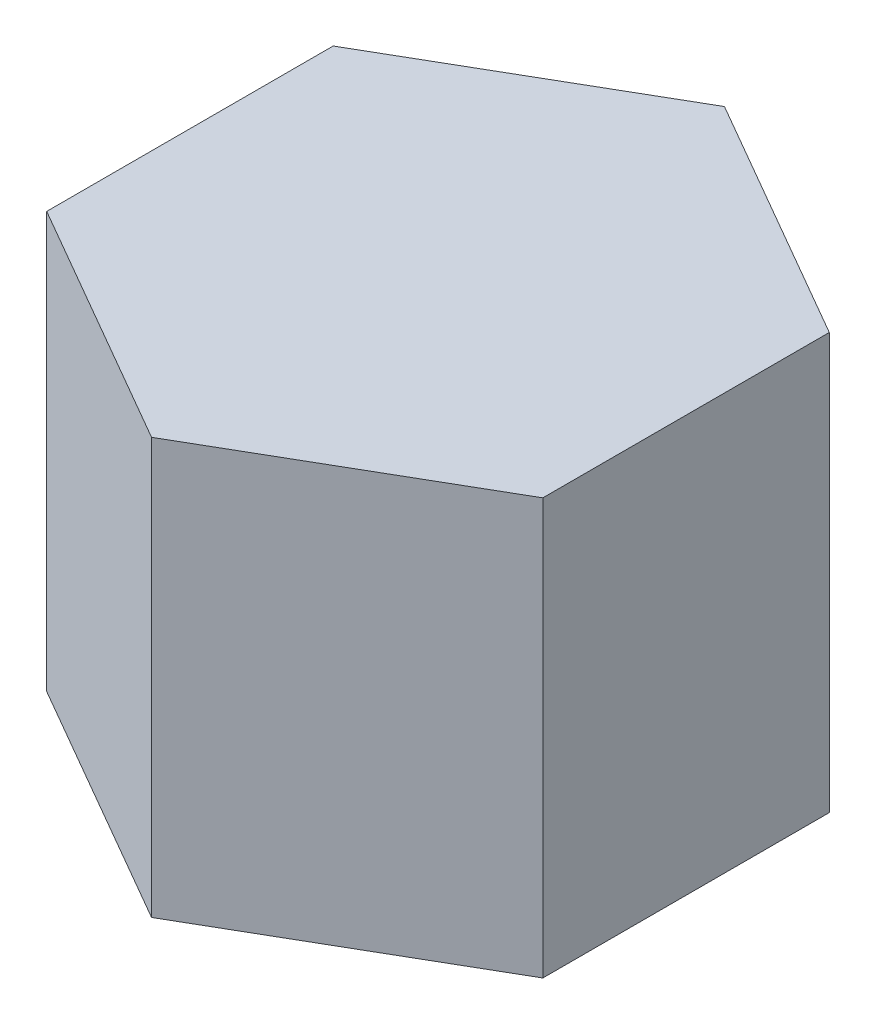
ISO-10303-21;
HEADER;
FILE_DESCRIPTION(('STEP AP214'),'2;1');
FILE_NAME('part.step','',(''),(''),'','','');
FILE_SCHEMA(('AUTOMOTIVE_DESIGN { 1 0 10303 214 1 1 1 1 }'));
ENDSEC;
DATA;
#1=APPLICATION_CONTEXT('core data for automotive mechanical design processes');
#2=APPLICATION_PROTOCOL_DEFINITION('international standard','automotive_design',2000,#1);
#3=PRODUCT_CONTEXT('',#1,'mechanical');
#4=PRODUCT('Part','Part','',(#3));
#5=PRODUCT_RELATED_PRODUCT_CATEGORY('part','',(#4));
#6=PRODUCT_DEFINITION_FORMATION('','',#4);
#7=PRODUCT_DEFINITION_CONTEXT('part definition',#1,'design');
#8=PRODUCT_DEFINITION('design','',#6,#7);
#9=PRODUCT_DEFINITION_SHAPE('','',#8);
#10=(LENGTH_UNIT() NAMED_UNIT(*) SI_UNIT(.MILLI.,.METRE.));
#11=(NAMED_UNIT(*) PLANE_ANGLE_UNIT() SI_UNIT($,.RADIAN.));
#12=(NAMED_UNIT(*) SI_UNIT($,.STERADIAN.) SOLID_ANGLE_UNIT());
#13=UNCERTAINTY_MEASURE_WITH_UNIT(LENGTH_MEASURE(1.E-05),#10,'distance_accuracy_value','');
#14=(GEOMETRIC_REPRESENTATION_CONTEXT(3) GLOBAL_UNCERTAINTY_ASSIGNED_CONTEXT((#13)) GLOBAL_UNIT_ASSIGNED_CONTEXT((#10,
#11,#12)) REPRESENTATION_CONTEXT('',''));
#15=CARTESIAN_POINT('',(0.,0.,0.));
#16=DIRECTION('',(0.,0.,1.));
#17=DIRECTION('',(1.,0.,0.));
#18=AXIS2_PLACEMENT_3D('',#15,#16,#17);
#19=CARTESIAN_POINT('',(203.142660308706,-148.537700895744,287.176844201572));
#20=DIRECTION('',(-0.499999999999943,0.,-0.866025403784472));
#21=DIRECTION('',(-0.866025403784472,0.,0.499999999999943));
#22=AXIS2_PLACEMENT_3D('',#19,#20,#21);
#23=PLANE('',#22);
#24=CARTESIAN_POINT('',(202.839551417382,-149.045793579175,287.351844201572));
#25=DIRECTION('',(0.866025403784471,0.,-0.499999999999943));
#26=VECTOR('',#25,1.);
#27=LINE('',#24,#26);
#28=CARTESIAN_POINT('',(202.839551417382,-149.045793579175,287.351844201572));
#29=VERTEX_POINT('',#28);
#30=CARTESIAN_POINT('',(203.142660308706,-149.045793579175,287.176844201572));
#31=VERTEX_POINT('',#30);
#32=EDGE_CURVE('E170',#29,#31,#27,.T.);
#33=ORIENTED_EDGE('',*,*,#32,.T.);
#34=CARTESIAN_POINT('',(203.142660308706,-148.537700895744,287.176844201572));
#35=DIRECTION('',(0.,-1.,0.));
#36=VECTOR('',#35,1.);
#37=LINE('',#34,#36);
#38=CARTESIAN_POINT('',(203.142660308706,-148.537700895744,287.176844201572));
#39=VERTEX_POINT('',#38);
#40=EDGE_CURVE('E35',#39,#31,#37,.T.);
#41=ORIENTED_EDGE('',*,*,#40,.F.);
#42=CARTESIAN_POINT('',(202.839551417382,-148.537700895744,287.351844201572));
#43=DIRECTION('',(0.866025403784471,0.,-0.499999999999943));
#44=VECTOR('',#43,1.);
#45=LINE('',#42,#44);
#46=CARTESIAN_POINT('',(202.839551417382,-148.537700895744,287.351844201572));
#47=VERTEX_POINT('',#46);
#48=EDGE_CURVE('E159',#47,#39,#45,.T.);
#49=ORIENTED_EDGE('',*,*,#48,.F.);
#50=CARTESIAN_POINT('',(202.839551417382,-148.537700895744,287.351844201572));
#51=DIRECTION('',(0.,-1.,0.));
#52=VECTOR('',#51,1.);
#53=LINE('',#50,#52);
#54=EDGE_CURVE('E10',#47,#29,#53,.T.);
#55=ORIENTED_EDGE('',*,*,#54,.T.);
#56=EDGE_LOOP('',(#33,#41,#49,#55));
#57=FACE_BOUND('',#56,.T.);
#58=ADVANCED_FACE('F16',(#57),#23,.F.);
#59=CARTESIAN_POINT('',(202.839551417382,-148.537700895744,287.351844201572));
#60=DIRECTION('',(0.500000000000062,0.,-0.866025403784403));
#61=DIRECTION('',(-0.866025403784403,0.,-0.500000000000062));
#62=AXIS2_PLACEMENT_3D('',#59,#60,#61);
#63=PLANE('',#62);
#64=CARTESIAN_POINT('',(202.536442526057,-149.045793579175,287.176844201572));
#65=DIRECTION('',(0.866025403784403,0.,0.500000000000062));
#66=VECTOR('',#65,1.);
#67=LINE('',#64,#66);
#68=CARTESIAN_POINT('',(202.536442526057,-149.045793579175,287.176844201572));
#69=VERTEX_POINT('',#68);
#70=EDGE_CURVE('E167',#69,#29,#67,.T.);
#71=ORIENTED_EDGE('',*,*,#70,.T.);
#72=ORIENTED_EDGE('',*,*,#54,.F.);
#73=CARTESIAN_POINT('',(202.536442526057,-148.537700895744,287.176844201572));
#74=DIRECTION('',(0.866025403784403,0.,0.500000000000062));
#75=VECTOR('',#74,1.);
#76=LINE('',#73,#75);
#77=CARTESIAN_POINT('',(202.536442526057,-148.537700895744,287.176844201572));
#78=VERTEX_POINT('',#77);
#79=EDGE_CURVE('E156',#78,#47,#76,.T.);
#80=ORIENTED_EDGE('',*,*,#79,.F.);
#81=CARTESIAN_POINT('',(202.536442526057,-148.537700895744,287.176844201572));
#82=DIRECTION('',(0.,-1.,0.));
#83=VECTOR('',#82,1.);
#84=LINE('',#81,#83);
#85=EDGE_CURVE('E27',#78,#69,#84,.T.);
#86=ORIENTED_EDGE('',*,*,#85,.T.);
#87=EDGE_LOOP('',(#71,#72,#80,#86));
#88=FACE_BOUND('',#87,.T.);
#89=ADVANCED_FACE('F189',(#88),#63,.F.);
#90=CARTESIAN_POINT('',(202.536442526057,-148.537700895744,290.831971220494));
#91=DIRECTION('',(1.,0.,0.));
#92=DIRECTION('',(0.,1.,0.));
#93=AXIS2_PLACEMENT_3D('',#90,#91,#92);
#94=PLANE('',#93);
#95=CARTESIAN_POINT('',(202.536442526057,-149.045793579175,286.826844201572));
#96=DIRECTION('',(0.,0.,1.));
#97=VECTOR('',#96,1.);
#98=LINE('',#95,#97);
#99=CARTESIAN_POINT('',(202.536442526057,-149.045793579175,286.826844201572));
#100=VERTEX_POINT('',#99);
#101=EDGE_CURVE('E163',#100,#69,#98,.T.);
#102=ORIENTED_EDGE('',*,*,#101,.T.);
#103=ORIENTED_EDGE('',*,*,#85,.F.);
#104=CARTESIAN_POINT('',(202.536442526057,-148.537700895744,286.826844201572));
#105=DIRECTION('',(0.,0.,1.));
#106=VECTOR('',#105,1.);
#107=LINE('',#104,#106);
#108=CARTESIAN_POINT('',(202.536442526057,-148.537700895744,286.826844201572));
#109=VERTEX_POINT('',#108);
#110=EDGE_CURVE('E106',#109,#78,#107,.T.);
#111=ORIENTED_EDGE('',*,*,#110,.F.);
#112=CARTESIAN_POINT('',(202.536442526057,-148.537700895744,286.826844201572));
#113=DIRECTION('',(0.,-1.,0.));
#114=VECTOR('',#113,1.);
#115=LINE('',#112,#114);
#116=EDGE_CURVE('E94',#109,#100,#115,.T.);
#117=ORIENTED_EDGE('',*,*,#116,.T.);
#118=EDGE_LOOP('',(#102,#103,#111,#117));
#119=FACE_BOUND('',#118,.T.);
#120=ADVANCED_FACE('F198',(#119),#94,.F.);
#121=CARTESIAN_POINT('',(202.536442526057,-148.537700895744,286.826844201572));
#122=DIRECTION('',(0.499999999999978,0.,0.866025403784452));
#123=DIRECTION('',(0.866025403784452,0.,-0.499999999999978));
#124=AXIS2_PLACEMENT_3D('',#121,#122,#123);
#125=PLANE('',#124);
#126=CARTESIAN_POINT('',(202.839551417382,-149.045793579175,286.651844201572));
#127=DIRECTION('',(-0.866025403784452,0.,0.499999999999978));
#128=VECTOR('',#127,1.);
#129=LINE('',#126,#128);
#130=CARTESIAN_POINT('',(202.839551417382,-149.045793579175,286.651844201572));
#131=VERTEX_POINT('',#130);
#132=EDGE_CURVE('E162',#131,#100,#129,.T.);
#133=ORIENTED_EDGE('',*,*,#132,.T.);
#134=ORIENTED_EDGE('',*,*,#116,.F.);
#135=CARTESIAN_POINT('',(202.839551417382,-148.537700895744,286.651844201572));
#136=DIRECTION('',(-0.866025403784452,0.,0.499999999999978));
#137=VECTOR('',#136,1.);
#138=LINE('',#135,#137);
#139=CARTESIAN_POINT('',(202.839551417382,-148.537700895744,286.651844201572));
#140=VERTEX_POINT('',#139);
#141=EDGE_CURVE('E98',#140,#109,#138,.T.);
#142=ORIENTED_EDGE('',*,*,#141,.F.);
#143=CARTESIAN_POINT('',(202.839551417382,-148.537700895744,286.651844201572));
#144=DIRECTION('',(0.,-1.,0.));
#145=VECTOR('',#144,1.);
#146=LINE('',#143,#145);
#147=EDGE_CURVE('E79',#140,#131,#146,.T.);
#148=ORIENTED_EDGE('',*,*,#147,.T.);
#149=EDGE_LOOP('',(#133,#134,#142,#148));
#150=FACE_BOUND('',#149,.T.);
#151=ADVANCED_FACE('F100',(#150),#125,.F.);
#152=CARTESIAN_POINT('',(202.839551417382,-148.537700895744,286.651844201572));
#153=DIRECTION('',(-0.499999999999978,0.,0.866025403784452));
#154=DIRECTION('',(0.866025403784452,0.,0.499999999999978));
#155=AXIS2_PLACEMENT_3D('',#152,#153,#154);
#156=PLANE('',#155);
#157=CARTESIAN_POINT('',(203.142660308706,-149.045793579175,286.826844201572));
#158=DIRECTION('',(-0.866025403784452,0.,-0.499999999999978));
#159=VECTOR('',#158,1.);
#160=LINE('',#157,#159);
#161=CARTESIAN_POINT('',(203.142660308706,-149.045793579175,286.826844201572));
#162=VERTEX_POINT('',#161);
#163=EDGE_CURVE('E88',#162,#131,#160,.T.);
#164=ORIENTED_EDGE('',*,*,#163,.T.);
#165=ORIENTED_EDGE('',*,*,#147,.F.);
#166=CARTESIAN_POINT('',(203.142660308706,-148.537700895744,286.826844201572));
#167=DIRECTION('',(-0.866025403784452,0.,-0.499999999999978));
#168=VECTOR('',#167,1.);
#169=LINE('',#166,#168);
#170=CARTESIAN_POINT('',(203.142660308706,-148.537700895744,286.826844201572));
#171=VERTEX_POINT('',#170);
#172=EDGE_CURVE('E84',#171,#140,#169,.T.);
#173=ORIENTED_EDGE('',*,*,#172,.F.);
#174=CARTESIAN_POINT('',(203.142660308706,-148.537700895744,286.826844201572));
#175=DIRECTION('',(0.,-1.,0.));
#176=VECTOR('',#175,1.);
#177=LINE('',#174,#176);
#178=EDGE_CURVE('E58',#171,#162,#177,.T.);
#179=ORIENTED_EDGE('',*,*,#178,.T.);
#180=EDGE_LOOP('',(#164,#165,#173,#179));
#181=FACE_BOUND('',#180,.T.);
#182=ADVANCED_FACE('F82',(#181),#156,.F.);
#183=CARTESIAN_POINT('',(203.142660308706,-148.537700895744,290.831971220494));
#184=DIRECTION('',(-1.,0.,0.));
#185=DIRECTION('',(0.,-1.,0.));
#186=AXIS2_PLACEMENT_3D('',#183,#184,#185);
#187=PLANE('',#186);
#188=CARTESIAN_POINT('',(203.142660308706,-149.045793579175,287.176844201572));
#189=DIRECTION('',(0.,0.,-1.));
#190=VECTOR('',#189,1.);
#191=LINE('',#188,#190);
#192=EDGE_CURVE('E160',#31,#162,#191,.T.);
#193=ORIENTED_EDGE('',*,*,#192,.T.);
#194=ORIENTED_EDGE('',*,*,#178,.F.);
#195=CARTESIAN_POINT('',(203.142660308706,-148.537700895744,287.176844201572));
#196=DIRECTION('',(0.,0.,-1.));
#197=VECTOR('',#196,1.);
#198=LINE('',#195,#197);
#199=EDGE_CURVE('E112',#39,#171,#198,.T.);
#200=ORIENTED_EDGE('',*,*,#199,.F.);
#201=ORIENTED_EDGE('',*,*,#40,.T.);
#202=EDGE_LOOP('',(#193,#194,#200,#201));
#203=FACE_BOUND('',#202,.T.);
#204=ADVANCED_FACE('F131',(#203),#187,.F.);
#205=CARTESIAN_POINT('',(206.339551417382,-148.537700895744,290.831971220494));
#206=DIRECTION('',(0.,-1.,0.));
#207=DIRECTION('',(1.,0.,0.));
#208=AXIS2_PLACEMENT_3D('',#205,#206,#207);
#209=PLANE('',#208);
#210=ORIENTED_EDGE('',*,*,#48,.T.);
#211=ORIENTED_EDGE('',*,*,#199,.T.);
#212=ORIENTED_EDGE('',*,*,#172,.T.);
#213=ORIENTED_EDGE('',*,*,#141,.T.);
#214=ORIENTED_EDGE('',*,*,#110,.T.);
#215=ORIENTED_EDGE('',*,*,#79,.T.);
#216=EDGE_LOOP('',(#210,#211,#212,#213,#214,#215));
#217=FACE_BOUND('',#216,.T.);
#218=ADVANCED_FACE('F111',(#217),#209,.F.);
#219=CARTESIAN_POINT('',(206.339551417382,-149.045793579175,290.831971220494));
#220=DIRECTION('',(0.,-1.,0.));
#221=DIRECTION('',(1.,0.,0.));
#222=AXIS2_PLACEMENT_3D('',#219,#220,#221);
#223=PLANE('',#222);
#224=ORIENTED_EDGE('',*,*,#32,.F.);
#225=ORIENTED_EDGE('',*,*,#70,.F.);
#226=ORIENTED_EDGE('',*,*,#101,.F.);
#227=ORIENTED_EDGE('',*,*,#132,.F.);
#228=ORIENTED_EDGE('',*,*,#163,.F.);
#229=ORIENTED_EDGE('',*,*,#192,.F.);
#230=EDGE_LOOP('',(#224,#225,#226,#227,#228,#229));
#231=FACE_BOUND('',#230,.T.);
#232=ADVANCED_FACE('F130',(#231),#223,.T.);
#233=CLOSED_SHELL('',(#58,#89,#120,#151,#182,#204,#218,#232));
#234=MANIFOLD_SOLID_BREP('B1',#233);
#235=ADVANCED_BREP_SHAPE_REPRESENTATION('',(#18,#234),#14);
#236=SHAPE_DEFINITION_REPRESENTATION(#9,#235);
ENDSEC;
END-ISO-10303-21;
